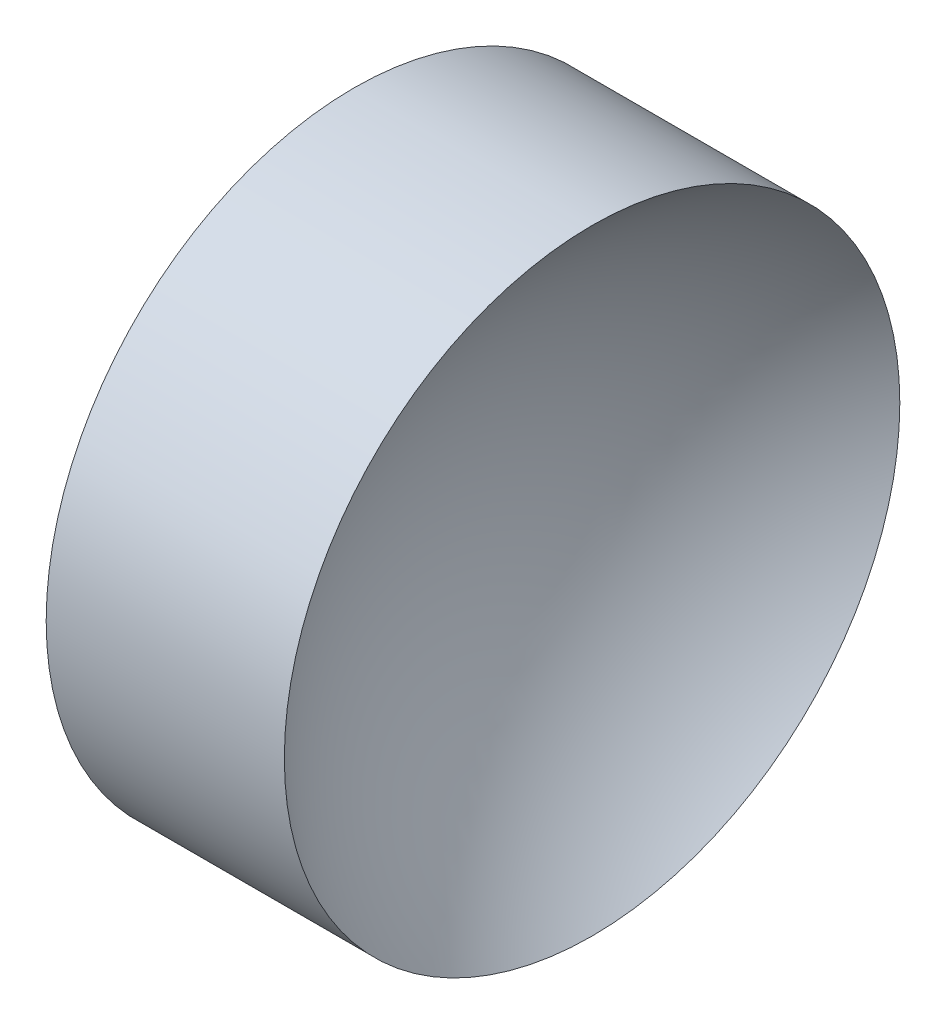
ISO-10303-21;
HEADER;
FILE_DESCRIPTION(('STEP AP214'),'2;1');
FILE_NAME('part.step','',(''),(''),'','','');
FILE_SCHEMA(('AUTOMOTIVE_DESIGN { 1 0 10303 214 1 1 1 1 }'));
ENDSEC;
DATA;
#1=APPLICATION_CONTEXT('core data for automotive mechanical design processes');
#2=APPLICATION_PROTOCOL_DEFINITION('international standard','automotive_design',2000,#1);
#3=PRODUCT_CONTEXT('',#1,'mechanical');
#4=PRODUCT('Part','Part','',(#3));
#5=PRODUCT_RELATED_PRODUCT_CATEGORY('part','',(#4));
#6=PRODUCT_DEFINITION_FORMATION('','',#4);
#7=PRODUCT_DEFINITION_CONTEXT('part definition',#1,'design');
#8=PRODUCT_DEFINITION('design','',#6,#7);
#9=PRODUCT_DEFINITION_SHAPE('','',#8);
#10=(LENGTH_UNIT() NAMED_UNIT(*) SI_UNIT(.MILLI.,.METRE.));
#11=(NAMED_UNIT(*) PLANE_ANGLE_UNIT() SI_UNIT($,.RADIAN.));
#12=(NAMED_UNIT(*) SI_UNIT($,.STERADIAN.) SOLID_ANGLE_UNIT());
#13=UNCERTAINTY_MEASURE_WITH_UNIT(LENGTH_MEASURE(1.E-05),#10,'distance_accuracy_value','');
#14=(GEOMETRIC_REPRESENTATION_CONTEXT(3) GLOBAL_UNCERTAINTY_ASSIGNED_CONTEXT((#13)) GLOBAL_UNIT_ASSIGNED_CONTEXT((#10,
#11,#12)) REPRESENTATION_CONTEXT('',''));
#15=CARTESIAN_POINT('',(0.,0.,0.));
#16=DIRECTION('',(0.,0.,1.));
#17=DIRECTION('',(1.,0.,0.));
#18=AXIS2_PLACEMENT_3D('',#15,#16,#17);
#19=CARTESIAN_POINT('',(30.3842320536207,13.031126091403,0.));
#20=DIRECTION('',(-1.,0.,0.));
#21=DIRECTION('',(0.,-1.,0.));
#22=AXIS2_PLACEMENT_3D('',#19,#20,#21);
#23=SPHERICAL_SURFACE('',#22,6.46);
#24=CARTESIAN_POINT('',(26.2938042031385,13.031126091403,0.));
#25=DIRECTION('',(-1.,0.,0.));
#26=DIRECTION('',(0.,-1.,0.));
#27=AXIS2_PLACEMENT_3D('',#24,#25,#26);
#28=CIRCLE('',#27,5.);
#29=CARTESIAN_POINT('',(26.2938042031385,8.03112609140304,0.));
#30=VERTEX_POINT('',#29);
#31=EDGE_CURVE('E10',#30,#30,#28,.T.);
#32=ORIENTED_EDGE('',*,*,#31,.F.);
#33=EDGE_LOOP('',(#32));
#34=FACE_BOUND('',#33,.T.);
#35=ADVANCED_FACE('F35',(#34),#23,.F.);
#36=CARTESIAN_POINT('',(21.5059751180825,13.031126091403,0.));
#37=DIRECTION('',(-1.,0.,0.));
#38=DIRECTION('',(0.,-1.,0.));
#39=AXIS2_PLACEMENT_3D('',#36,#37,#38);
#40=CYLINDRICAL_SURFACE('',#39,5.);
#41=CARTESIAN_POINT('',(22.4242320536207,13.031126091403,0.));
#42=DIRECTION('',(-1.,0.,0.));
#43=DIRECTION('',(0.,-1.,0.));
#44=AXIS2_PLACEMENT_3D('',#41,#42,#43);
#45=CIRCLE('',#44,5.);
#46=CARTESIAN_POINT('',(22.4242320536207,8.03112609140304,0.));
#47=VERTEX_POINT('',#46);
#48=EDGE_CURVE('E41',#47,#47,#45,.T.);
#49=ORIENTED_EDGE('',*,*,#48,.F.);
#50=EDGE_LOOP('',(#49));
#51=FACE_BOUND('',#50,.T.);
#52=ORIENTED_EDGE('',*,*,#31,.T.);
#53=EDGE_LOOP('',(#52));
#54=FACE_BOUND('',#53,.T.);
#55=ADVANCED_FACE('F49',(#51,#54),#40,.T.);
#56=CARTESIAN_POINT('',(22.4242320536207,13.031126091403,0.));
#57=DIRECTION('',(1.,0.,0.));
#58=DIRECTION('',(0.,1.,0.));
#59=AXIS2_PLACEMENT_3D('',#56,#57,#58);
#60=PLANE('',#59);
#61=ORIENTED_EDGE('',*,*,#48,.T.);
#62=EDGE_LOOP('',(#61));
#63=FACE_BOUND('',#62,.T.);
#64=ADVANCED_FACE('F47',(#63),#60,.F.);
#65=CLOSED_SHELL('',(#35,#55,#64));
#66=MANIFOLD_SOLID_BREP('B2',#65);
#67=ADVANCED_BREP_SHAPE_REPRESENTATION('',(#18,#66),#14);
#68=SHAPE_DEFINITION_REPRESENTATION(#9,#67);
ENDSEC;
END-ISO-10303-21;
